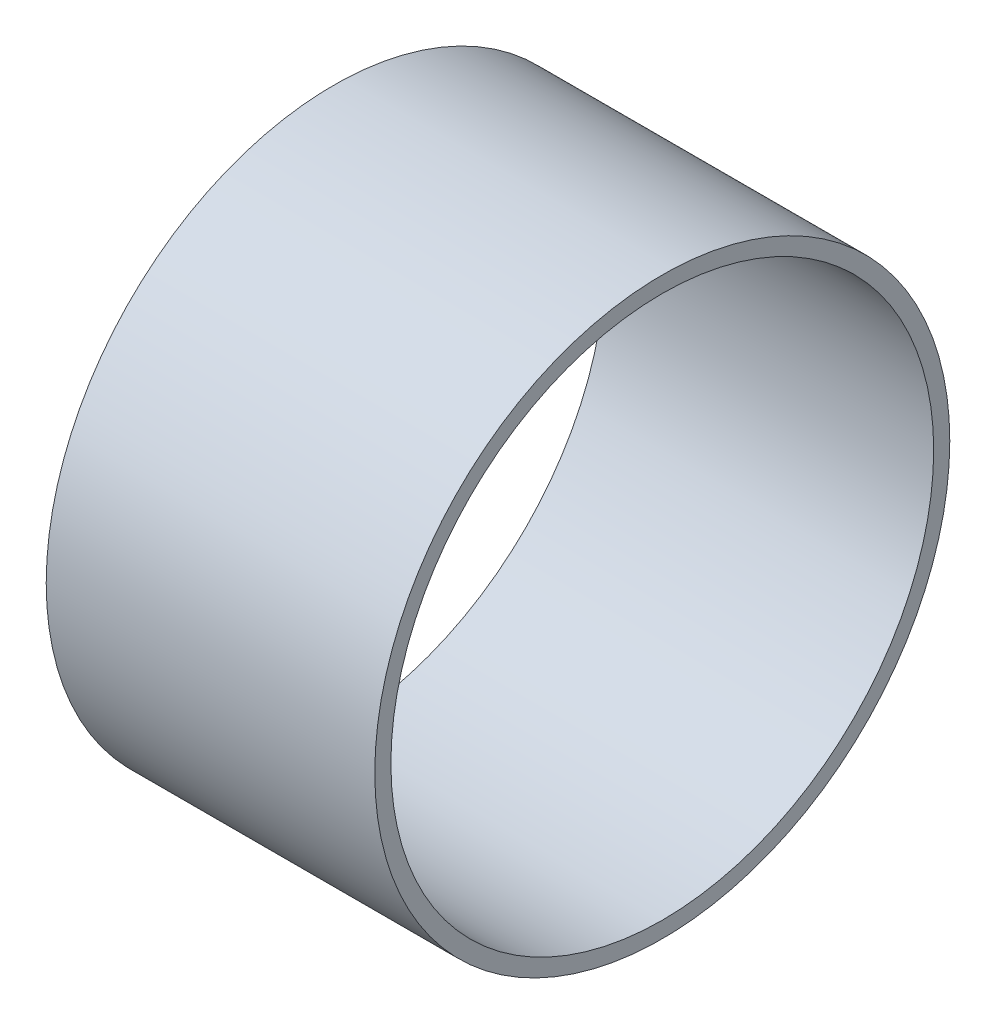
ISO-10303-21;
HEADER;
FILE_DESCRIPTION(('STEP AP214'),'2;1');
FILE_NAME('part.step','',(''),(''),'','','');
FILE_SCHEMA(('AUTOMOTIVE_DESIGN { 1 0 10303 214 1 1 1 1 }'));
ENDSEC;
DATA;
#1=APPLICATION_CONTEXT('core data for automotive mechanical design processes');
#2=APPLICATION_PROTOCOL_DEFINITION('international standard','automotive_design',2000,#1);
#3=PRODUCT_CONTEXT('',#1,'mechanical');
#4=PRODUCT('Part','Part','',(#3));
#5=PRODUCT_RELATED_PRODUCT_CATEGORY('part','',(#4));
#6=PRODUCT_DEFINITION_FORMATION('','',#4);
#7=PRODUCT_DEFINITION_CONTEXT('part definition',#1,'design');
#8=PRODUCT_DEFINITION('design','',#6,#7);
#9=PRODUCT_DEFINITION_SHAPE('','',#8);
#10=(LENGTH_UNIT() NAMED_UNIT(*) SI_UNIT(.MILLI.,.METRE.));
#11=(NAMED_UNIT(*) PLANE_ANGLE_UNIT() SI_UNIT($,.RADIAN.));
#12=(NAMED_UNIT(*) SI_UNIT($,.STERADIAN.) SOLID_ANGLE_UNIT());
#13=UNCERTAINTY_MEASURE_WITH_UNIT(LENGTH_MEASURE(1.E-05),#10,'distance_accuracy_value','');
#14=(GEOMETRIC_REPRESENTATION_CONTEXT(3) GLOBAL_UNCERTAINTY_ASSIGNED_CONTEXT((#13)) GLOBAL_UNIT_ASSIGNED_CONTEXT((#10,
#11,#12)) REPRESENTATION_CONTEXT('',''));
#15=CARTESIAN_POINT('',(0.,0.,0.));
#16=DIRECTION('',(0.,0.,1.));
#17=DIRECTION('',(1.,0.,0.));
#18=AXIS2_PLACEMENT_3D('',#15,#16,#17);
#19=CARTESIAN_POINT('',(25.4,22.225,0.));
#20=DIRECTION('',(-1.,0.,0.));
#21=DIRECTION('',(0.,0.,1.));
#22=AXIS2_PLACEMENT_3D('',#19,#20,#21);
#23=CYLINDRICAL_SURFACE('',#22,22.225);
#24=CARTESIAN_POINT('',(25.4,22.225,0.));
#25=DIRECTION('',(-1.,0.,0.));
#26=DIRECTION('',(0.,0.,1.));
#27=AXIS2_PLACEMENT_3D('',#24,#25,#26);
#28=CIRCLE('',#27,22.225);
#29=CARTESIAN_POINT('',(25.4,22.225,22.225));
#30=VERTEX_POINT('',#29);
#31=EDGE_CURVE('E10',#30,#30,#28,.T.);
#32=ORIENTED_EDGE('',*,*,#31,.T.);
#33=EDGE_LOOP('',(#32));
#34=FACE_BOUND('',#33,.T.);
#35=CARTESIAN_POINT('',(0.,22.225,0.));
#36=DIRECTION('',(-1.,0.,0.));
#37=DIRECTION('',(0.,0.,1.));
#38=AXIS2_PLACEMENT_3D('',#35,#36,#37);
#39=CIRCLE('',#38,22.225);
#40=CARTESIAN_POINT('',(0.,22.225,22.225));
#41=VERTEX_POINT('',#40);
#42=EDGE_CURVE('E33',#41,#41,#39,.T.);
#43=ORIENTED_EDGE('',*,*,#42,.F.);
#44=EDGE_LOOP('',(#43));
#45=FACE_BOUND('',#44,.T.);
#46=ADVANCED_FACE('F30',(#34,#45),#23,.T.);
#47=CARTESIAN_POINT('',(25.4,22.225,0.));
#48=DIRECTION('',(-1.,0.,0.));
#49=DIRECTION('',(0.,0.,1.));
#50=AXIS2_PLACEMENT_3D('',#47,#48,#49);
#51=PLANE('',#50);
#52=CARTESIAN_POINT('',(25.4,22.225,0.));
#53=DIRECTION('',(-1.,0.,0.));
#54=DIRECTION('',(0.,0.,1.));
#55=AXIS2_PLACEMENT_3D('',#52,#53,#54);
#56=CIRCLE('',#55,20.9804);
#57=CARTESIAN_POINT('',(25.4,22.225,20.9804));
#58=VERTEX_POINT('',#57);
#59=EDGE_CURVE('E40',#58,#58,#56,.T.);
#60=ORIENTED_EDGE('',*,*,#59,.T.);
#61=EDGE_LOOP('',(#60));
#62=FACE_BOUND('',#61,.T.);
#63=ORIENTED_EDGE('',*,*,#31,.F.);
#64=EDGE_LOOP('',(#63));
#65=FACE_BOUND('',#64,.T.);
#66=ADVANCED_FACE('F48',(#62,#65),#51,.F.);
#67=CARTESIAN_POINT('',(0.,22.225,0.));
#68=DIRECTION('',(-1.,0.,0.));
#69=DIRECTION('',(0.,0.,1.));
#70=AXIS2_PLACEMENT_3D('',#67,#68,#69);
#71=PLANE('',#70);
#72=CARTESIAN_POINT('',(0.,22.225,0.));
#73=DIRECTION('',(-1.,0.,0.));
#74=DIRECTION('',(0.,0.,1.));
#75=AXIS2_PLACEMENT_3D('',#72,#73,#74);
#76=CIRCLE('',#75,20.9804);
#77=CARTESIAN_POINT('',(0.,22.225,20.9804));
#78=VERTEX_POINT('',#77);
#79=EDGE_CURVE('E42',#78,#78,#76,.T.);
#80=ORIENTED_EDGE('',*,*,#79,.F.);
#81=EDGE_LOOP('',(#80));
#82=FACE_BOUND('',#81,.T.);
#83=ORIENTED_EDGE('',*,*,#42,.T.);
#84=EDGE_LOOP('',(#83));
#85=FACE_BOUND('',#84,.T.);
#86=ADVANCED_FACE('F54',(#82,#85),#71,.T.);
#87=CARTESIAN_POINT('',(25.4,22.225,0.));
#88=DIRECTION('',(-1.,0.,0.));
#89=DIRECTION('',(0.,0.,1.));
#90=AXIS2_PLACEMENT_3D('',#87,#88,#89);
#91=CYLINDRICAL_SURFACE('',#90,20.9804);
#92=ORIENTED_EDGE('',*,*,#59,.F.);
#93=EDGE_LOOP('',(#92));
#94=FACE_BOUND('',#93,.T.);
#95=ORIENTED_EDGE('',*,*,#79,.T.);
#96=EDGE_LOOP('',(#95));
#97=FACE_BOUND('',#96,.T.);
#98=ADVANCED_FACE('F51',(#94,#97),#91,.F.);
#99=CLOSED_SHELL('',(#46,#66,#86,#98));
#100=MANIFOLD_SOLID_BREP('B2',#99);
#101=ADVANCED_BREP_SHAPE_REPRESENTATION('',(#18,#100),#14);
#102=SHAPE_DEFINITION_REPRESENTATION(#9,#101);
ENDSEC;
END-ISO-10303-21;
